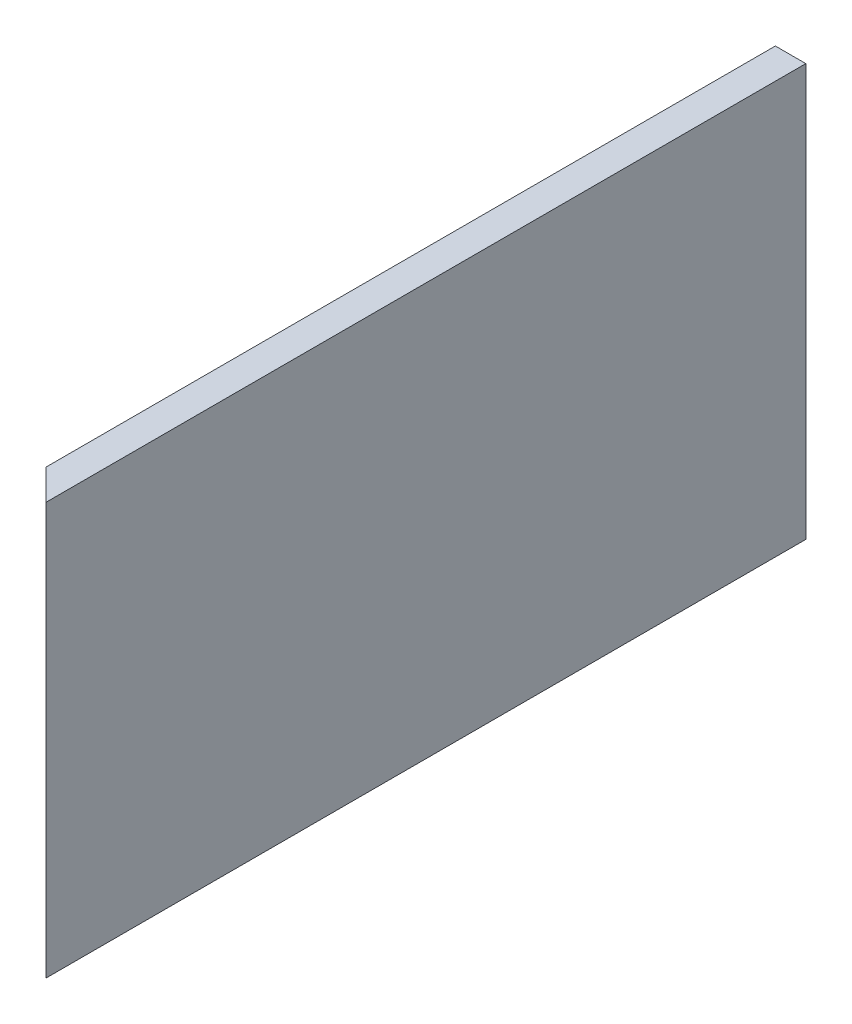
ISO-10303-21;
HEADER;
FILE_DESCRIPTION(('STEP AP214'),'2;1');
FILE_NAME('part.step','',(''),(''),'','','');
FILE_SCHEMA(('AUTOMOTIVE_DESIGN { 1 0 10303 214 1 1 1 1 }'));
ENDSEC;
DATA;
#1=APPLICATION_CONTEXT('core data for automotive mechanical design processes');
#2=APPLICATION_PROTOCOL_DEFINITION('international standard','automotive_design',2000,#1);
#3=PRODUCT_CONTEXT('',#1,'mechanical');
#4=PRODUCT('Part','Part','',(#3));
#5=PRODUCT_RELATED_PRODUCT_CATEGORY('part','',(#4));
#6=PRODUCT_DEFINITION_FORMATION('','',#4);
#7=PRODUCT_DEFINITION_CONTEXT('part definition',#1,'design');
#8=PRODUCT_DEFINITION('design','',#6,#7);
#9=PRODUCT_DEFINITION_SHAPE('','',#8);
#10=(LENGTH_UNIT() NAMED_UNIT(*) SI_UNIT(.MILLI.,.METRE.));
#11=(NAMED_UNIT(*) PLANE_ANGLE_UNIT() SI_UNIT($,.RADIAN.));
#12=(NAMED_UNIT(*) SI_UNIT($,.STERADIAN.) SOLID_ANGLE_UNIT());
#13=UNCERTAINTY_MEASURE_WITH_UNIT(LENGTH_MEASURE(1.E-05),#10,'distance_accuracy_value','');
#14=(GEOMETRIC_REPRESENTATION_CONTEXT(3) GLOBAL_UNCERTAINTY_ASSIGNED_CONTEXT((#13)) GLOBAL_UNIT_ASSIGNED_CONTEXT((#10,
#11,#12)) REPRESENTATION_CONTEXT('',''));
#15=CARTESIAN_POINT('',(0.,0.,0.));
#16=DIRECTION('',(0.,0.,1.));
#17=DIRECTION('',(1.,0.,0.));
#18=AXIS2_PLACEMENT_3D('',#15,#16,#17);
#19=CARTESIAN_POINT('',(303.885599999999,171.7294,518.097413805219));
#20=DIRECTION('',(1.,0.,0.));
#21=DIRECTION('',(0.,1.,0.));
#22=AXIS2_PLACEMENT_3D('',#19,#20,#21);
#23=PLANE('',#22);
#24=DIRECTION('',(0.,-1.,0.));
#25=VECTOR('',#24,1.);
#26=CARTESIAN_POINT('',(303.885599999999,171.729399999998,303.885599999999));
#27=LINE('',#26,#25);
#28=CARTESIAN_POINT('',(303.885599999999,171.7294,303.885599999999));
#29=VERTEX_POINT('',#28);
#30=CARTESIAN_POINT('',(303.8856,0.,303.8856));
#31=VERTEX_POINT('',#30);
#32=EDGE_CURVE('E90',#29,#31,#27,.T.);
#33=ORIENTED_EDGE('',*,*,#32,.F.);
#34=DIRECTION('',(0.,0.,-1.));
#35=VECTOR('',#34,1.);
#36=CARTESIAN_POINT('',(303.885599999999,171.7294,518.097413805219));
#37=LINE('',#36,#35);
#38=CARTESIAN_POINT('',(303.885599999999,171.7294,0.));
#39=VERTEX_POINT('',#38);
#40=EDGE_CURVE('E43',#29,#39,#37,.T.);
#41=ORIENTED_EDGE('',*,*,#40,.T.);
#42=DIRECTION('',(0.,-1.,0.));
#43=VECTOR('',#42,1.);
#44=CARTESIAN_POINT('',(303.885599999999,171.7294,0.));
#45=LINE('',#44,#43);
#46=CARTESIAN_POINT('',(303.8856,0.,0.));
#47=VERTEX_POINT('',#46);
#48=EDGE_CURVE('E88',#39,#47,#45,.T.);
#49=ORIENTED_EDGE('',*,*,#48,.T.);
#50=DIRECTION('',(0.,0.,-1.));
#51=VECTOR('',#50,1.);
#52=CARTESIAN_POINT('',(303.8856,0.,518.097413805219));
#53=LINE('',#52,#51);
#54=EDGE_CURVE('E79',#31,#47,#53,.T.);
#55=ORIENTED_EDGE('',*,*,#54,.F.);
#56=EDGE_LOOP('',(#33,#41,#49,#55));
#57=FACE_BOUND('',#56,.T.);
#58=ADVANCED_FACE('F39',(#57),#23,.F.);
#59=CARTESIAN_POINT('',(303.8856,0.,518.097413805219));
#60=DIRECTION('',(0.,1.,0.));
#61=DIRECTION('',(0.,0.,1.));
#62=AXIS2_PLACEMENT_3D('',#59,#60,#61);
#63=PLANE('',#62);
#64=DIRECTION('',(0.707106781186548,0.,0.707106781186547));
#65=VECTOR('',#64,1.);
#66=CARTESIAN_POINT('',(410.991506902609,0.,410.991506902609));
#67=LINE('',#66,#65);
#68=CARTESIAN_POINT('',(316.5856,0.,316.585599999999));
#69=VERTEX_POINT('',#68);
#70=EDGE_CURVE('E49',#31,#69,#67,.T.);
#71=ORIENTED_EDGE('',*,*,#70,.F.);
#72=ORIENTED_EDGE('',*,*,#54,.T.);
#73=DIRECTION('',(1.,0.,0.));
#74=VECTOR('',#73,1.);
#75=CARTESIAN_POINT('',(303.8856,0.,0.));
#76=LINE('',#75,#74);
#77=CARTESIAN_POINT('',(316.5856,0.,0.));
#78=VERTEX_POINT('',#77);
#79=EDGE_CURVE('E102',#47,#78,#76,.T.);
#80=ORIENTED_EDGE('',*,*,#79,.T.);
#81=DIRECTION('',(0.,0.,-1.));
#82=VECTOR('',#81,1.);
#83=CARTESIAN_POINT('',(316.5856,0.,518.097413805219));
#84=LINE('',#83,#82);
#85=EDGE_CURVE('E116',#69,#78,#84,.T.);
#86=ORIENTED_EDGE('',*,*,#85,.F.);
#87=EDGE_LOOP('',(#71,#72,#80,#86));
#88=FACE_BOUND('',#87,.T.);
#89=ADVANCED_FACE('F123',(#88),#63,.F.);
#90=CARTESIAN_POINT('',(316.5856,0.,518.097413805219));
#91=DIRECTION('',(-1.,0.,0.));
#92=DIRECTION('',(0.,-1.,0.));
#93=AXIS2_PLACEMENT_3D('',#90,#91,#92);
#94=PLANE('',#93);
#95=DIRECTION('',(0.,1.,0.));
#96=VECTOR('',#95,1.);
#97=CARTESIAN_POINT('',(316.5856,-1.49817977430545E-12,316.5856));
#98=LINE('',#97,#96);
#99=CARTESIAN_POINT('',(316.585599999999,171.7294,316.585599999999));
#100=VERTEX_POINT('',#99);
#101=EDGE_CURVE('E11',#69,#100,#98,.T.);
#102=ORIENTED_EDGE('',*,*,#101,.F.);
#103=ORIENTED_EDGE('',*,*,#85,.T.);
#104=DIRECTION('',(0.,1.,0.));
#105=VECTOR('',#104,1.);
#106=CARTESIAN_POINT('',(316.5856,0.,0.));
#107=LINE('',#106,#105);
#108=CARTESIAN_POINT('',(316.585599999999,171.7294,0.));
#109=VERTEX_POINT('',#108);
#110=EDGE_CURVE('E118',#78,#109,#107,.T.);
#111=ORIENTED_EDGE('',*,*,#110,.T.);
#112=DIRECTION('',(0.,0.,-1.));
#113=VECTOR('',#112,1.);
#114=CARTESIAN_POINT('',(316.585599999999,171.7294,518.097413805219));
#115=LINE('',#114,#113);
#116=EDGE_CURVE('E62',#100,#109,#115,.T.);
#117=ORIENTED_EDGE('',*,*,#116,.F.);
#118=EDGE_LOOP('',(#102,#103,#111,#117));
#119=FACE_BOUND('',#118,.T.);
#120=ADVANCED_FACE('F122',(#119),#94,.F.);
#121=CARTESIAN_POINT('',(316.585599999999,171.7294,518.097413805219));
#122=DIRECTION('',(0.,-1.,0.));
#123=DIRECTION('',(0.,0.,-1.));
#124=AXIS2_PLACEMENT_3D('',#121,#122,#123);
#125=PLANE('',#124);
#126=DIRECTION('',(-0.707106781186548,0.,-0.707106781186547));
#127=VECTOR('',#126,1.);
#128=CARTESIAN_POINT('',(417.341506902609,171.7294,417.341506902609));
#129=LINE('',#128,#127);
#130=EDGE_CURVE('E99',#100,#29,#129,.T.);
#131=ORIENTED_EDGE('',*,*,#130,.F.);
#132=ORIENTED_EDGE('',*,*,#116,.T.);
#133=DIRECTION('',(-1.,0.,0.));
#134=VECTOR('',#133,1.);
#135=CARTESIAN_POINT('',(316.585599999999,171.7294,0.));
#136=LINE('',#135,#134);
#137=EDGE_CURVE('E94',#109,#39,#136,.T.);
#138=ORIENTED_EDGE('',*,*,#137,.T.);
#139=ORIENTED_EDGE('',*,*,#40,.F.);
#140=EDGE_LOOP('',(#131,#132,#138,#139));
#141=FACE_BOUND('',#140,.T.);
#142=ADVANCED_FACE('F95',(#141),#125,.F.);
#143=CARTESIAN_POINT('',(0.,0.,0.));
#144=DIRECTION('',(0.,0.,1.));
#145=DIRECTION('',(1.,0.,0.));
#146=AXIS2_PLACEMENT_3D('',#143,#144,#145);
#147=PLANE('',#146);
#148=ORIENTED_EDGE('',*,*,#48,.F.);
#149=ORIENTED_EDGE('',*,*,#137,.F.);
#150=ORIENTED_EDGE('',*,*,#110,.F.);
#151=ORIENTED_EDGE('',*,*,#79,.F.);
#152=EDGE_LOOP('',(#148,#149,#150,#151));
#153=FACE_BOUND('',#152,.T.);
#154=ADVANCED_FACE('F101',(#153),#147,.F.);
#155=CARTESIAN_POINT('',(0.,0.,0.));
#156=DIRECTION('',(-0.707106781186547,0.,0.707106781186548));
#157=DIRECTION('',(0.707106781186548,0.,0.707106781186547));
#158=AXIS2_PLACEMENT_3D('',#155,#156,#157);
#159=PLANE('',#158);
#160=ORIENTED_EDGE('',*,*,#130,.T.);
#161=ORIENTED_EDGE('',*,*,#32,.T.);
#162=ORIENTED_EDGE('',*,*,#70,.T.);
#163=ORIENTED_EDGE('',*,*,#101,.T.);
#164=EDGE_LOOP('',(#160,#161,#162,#163));
#165=FACE_BOUND('',#164,.T.);
#166=ADVANCED_FACE('F41',(#165),#159,.T.);
#167=CLOSED_SHELL('',(#58,#89,#120,#142,#154,#166));
#168=MANIFOLD_SOLID_BREP('B2',#167);
#169=ADVANCED_BREP_SHAPE_REPRESENTATION('',(#18,#168),#14);
#170=SHAPE_DEFINITION_REPRESENTATION(#9,#169);
ENDSEC;
END-ISO-10303-21;
